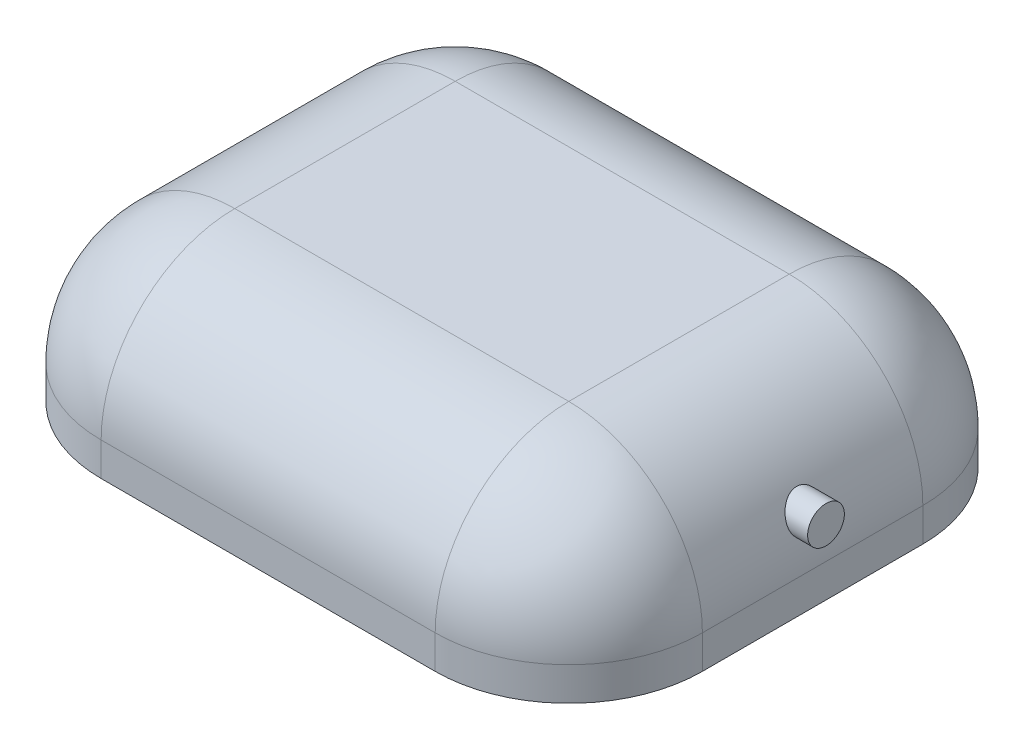
ISO-10303-21;
HEADER;
FILE_DESCRIPTION(('STEP AP214'),'2;1');
FILE_NAME('part.step','',(''),(''),'','','');
FILE_SCHEMA(('AUTOMOTIVE_DESIGN { 1 0 10303 214 1 1 1 1 }'));
ENDSEC;
DATA;
#1=APPLICATION_CONTEXT('core data for automotive mechanical design processes');
#2=APPLICATION_PROTOCOL_DEFINITION('international standard','automotive_design',2000,#1);
#3=PRODUCT_CONTEXT('',#1,'mechanical');
#4=PRODUCT('Part','Part','',(#3));
#5=PRODUCT_RELATED_PRODUCT_CATEGORY('part','',(#4));
#6=PRODUCT_DEFINITION_FORMATION('','',#4);
#7=PRODUCT_DEFINITION_CONTEXT('part definition',#1,'design');
#8=PRODUCT_DEFINITION('design','',#6,#7);
#9=PRODUCT_DEFINITION_SHAPE('','',#8);
#10=(LENGTH_UNIT() NAMED_UNIT(*) SI_UNIT(.MILLI.,.METRE.));
#11=(NAMED_UNIT(*) PLANE_ANGLE_UNIT() SI_UNIT($,.RADIAN.));
#12=(NAMED_UNIT(*) SI_UNIT($,.STERADIAN.) SOLID_ANGLE_UNIT());
#13=UNCERTAINTY_MEASURE_WITH_UNIT(LENGTH_MEASURE(1.E-05),#10,'distance_accuracy_value','');
#14=(GEOMETRIC_REPRESENTATION_CONTEXT(3) GLOBAL_UNCERTAINTY_ASSIGNED_CONTEXT((#13)) GLOBAL_UNIT_ASSIGNED_CONTEXT((#10,
#11,#12)) REPRESENTATION_CONTEXT('',''));
#15=CARTESIAN_POINT('',(0.,0.,0.));
#16=DIRECTION('',(0.,0.,1.));
#17=DIRECTION('',(1.,0.,0.));
#18=AXIS2_PLACEMENT_3D('',#15,#16,#17);
#19=CARTESIAN_POINT('',(22.5,12.5,18.25));
#20=DIRECTION('',(-1.,0.,0.));
#21=DIRECTION('',(0.,0.,1.));
#22=AXIS2_PLACEMENT_3D('',#19,#20,#21);
#23=PLANE('',#22);
#24=DIRECTION('',(0.,0.,-1.));
#25=VECTOR('',#24,1.);
#26=CARTESIAN_POINT('',(22.5,0.,18.25));
#27=LINE('',#26,#25);
#28=CARTESIAN_POINT('',(22.5,0.,8.25));
#29=VERTEX_POINT('',#28);
#30=CARTESIAN_POINT('',(22.5,0.,-8.25));
#31=VERTEX_POINT('',#30);
#32=EDGE_CURVE('E153',#29,#31,#27,.T.);
#33=ORIENTED_EDGE('',*,*,#32,.T.);
#34=DIRECTION('',(0.,-1.,0.));
#35=VECTOR('',#34,1.);
#36=CARTESIAN_POINT('',(22.5,12.5,-8.25));
#37=LINE('',#36,#35);
#38=CARTESIAN_POINT('',(22.5,2.5,-8.25));
#39=VERTEX_POINT('',#38);
#40=EDGE_CURVE('E178',#31,#39,#37,.F.);
#41=ORIENTED_EDGE('',*,*,#40,.T.);
#42=DIRECTION('',(0.,0.,-1.));
#43=VECTOR('',#42,1.);
#44=CARTESIAN_POINT('',(22.5,2.5,18.25));
#45=LINE('',#44,#43);
#46=CARTESIAN_POINT('',(22.5,2.5,8.25));
#47=VERTEX_POINT('',#46);
#48=EDGE_CURVE('E174',#39,#47,#45,.F.);
#49=ORIENTED_EDGE('',*,*,#48,.T.);
#50=DIRECTION('',(0.,-1.,0.));
#51=VECTOR('',#50,1.);
#52=CARTESIAN_POINT('',(22.5,12.5,8.25));
#53=LINE('',#52,#51);
#54=EDGE_CURVE('E176',#47,#29,#53,.T.);
#55=ORIENTED_EDGE('',*,*,#54,.T.);
#56=EDGE_LOOP('',(#33,#41,#49,#55));
#57=FACE_BOUND('',#56,.T.);
#58=ADVANCED_FACE('F34',(#57),#23,.F.);
#59=CARTESIAN_POINT('',(-22.5,12.5,18.25));
#60=DIRECTION('',(-1.,0.,0.));
#61=DIRECTION('',(0.,0.,1.));
#62=AXIS2_PLACEMENT_3D('',#59,#60,#61);
#63=PLANE('',#62);
#64=DIRECTION('',(0.,0.,-1.));
#65=VECTOR('',#64,1.);
#66=CARTESIAN_POINT('',(-22.5,2.5,-18.25));
#67=LINE('',#66,#65);
#68=CARTESIAN_POINT('',(-22.5,2.5,8.25));
#69=VERTEX_POINT('',#68);
#70=CARTESIAN_POINT('',(-22.5,2.5,-8.25));
#71=VERTEX_POINT('',#70);
#72=EDGE_CURVE('E186',#69,#71,#67,.T.);
#73=ORIENTED_EDGE('',*,*,#72,.T.);
#74=DIRECTION('',(0.,-1.,0.));
#75=VECTOR('',#74,1.);
#76=CARTESIAN_POINT('',(-22.5,12.5,-8.25));
#77=LINE('',#76,#75);
#78=CARTESIAN_POINT('',(-22.5,0.,-8.25));
#79=VERTEX_POINT('',#78);
#80=EDGE_CURVE('E190',#71,#79,#77,.T.);
#81=ORIENTED_EDGE('',*,*,#80,.T.);
#82=DIRECTION('',(0.,0.,-1.));
#83=VECTOR('',#82,1.);
#84=CARTESIAN_POINT('',(-22.5,0.,18.25));
#85=LINE('',#84,#83);
#86=CARTESIAN_POINT('',(-22.5,0.,8.25));
#87=VERTEX_POINT('',#86);
#88=EDGE_CURVE('E147',#87,#79,#85,.T.);
#89=ORIENTED_EDGE('',*,*,#88,.F.);
#90=DIRECTION('',(0.,-1.,0.));
#91=VECTOR('',#90,1.);
#92=CARTESIAN_POINT('',(-22.5,12.5,8.25));
#93=LINE('',#92,#91);
#94=EDGE_CURVE('E188',#87,#69,#93,.F.);
#95=ORIENTED_EDGE('',*,*,#94,.T.);
#96=EDGE_LOOP('',(#73,#81,#89,#95));
#97=FACE_BOUND('',#96,.T.);
#98=ADVANCED_FACE('F250',(#97),#63,.T.);
#99=CARTESIAN_POINT('',(-22.5,12.5,18.25));
#100=DIRECTION('',(0.,0.,-1.));
#101=DIRECTION('',(-1.,0.,0.));
#102=AXIS2_PLACEMENT_3D('',#99,#100,#101);
#103=PLANE('',#102);
#104=DIRECTION('',(1.,0.,0.));
#105=VECTOR('',#104,1.);
#106=CARTESIAN_POINT('',(-22.5,0.,18.25));
#107=LINE('',#106,#105);
#108=CARTESIAN_POINT('',(-12.5,0.,18.25));
#109=VERTEX_POINT('',#108);
#110=CARTESIAN_POINT('',(12.5,0.,18.25));
#111=VERTEX_POINT('',#110);
#112=EDGE_CURVE('E156',#109,#111,#107,.T.);
#113=ORIENTED_EDGE('',*,*,#112,.T.);
#114=DIRECTION('',(0.,-1.,0.));
#115=VECTOR('',#114,1.);
#116=CARTESIAN_POINT('',(12.5,12.5,18.25));
#117=LINE('',#116,#115);
#118=CARTESIAN_POINT('',(12.5,2.5,18.25));
#119=VERTEX_POINT('',#118);
#120=EDGE_CURVE('E184',#111,#119,#117,.F.);
#121=ORIENTED_EDGE('',*,*,#120,.T.);
#122=DIRECTION('',(1.,0.,0.));
#123=VECTOR('',#122,1.);
#124=CARTESIAN_POINT('',(-22.5,2.5,18.25));
#125=LINE('',#124,#123);
#126=CARTESIAN_POINT('',(-12.5,2.5,18.25));
#127=VERTEX_POINT('',#126);
#128=EDGE_CURVE('E180',#119,#127,#125,.F.);
#129=ORIENTED_EDGE('',*,*,#128,.T.);
#130=DIRECTION('',(0.,-1.,0.));
#131=VECTOR('',#130,1.);
#132=CARTESIAN_POINT('',(-12.5,0.,18.25));
#133=LINE('',#132,#131);
#134=EDGE_CURVE('E182',#127,#109,#133,.T.);
#135=ORIENTED_EDGE('',*,*,#134,.T.);
#136=EDGE_LOOP('',(#113,#121,#129,#135));
#137=FACE_BOUND('',#136,.T.);
#138=ADVANCED_FACE('F297',(#137),#103,.F.);
#139=CARTESIAN_POINT('',(-22.5,12.5,-18.25));
#140=DIRECTION('',(0.,0.,-1.));
#141=DIRECTION('',(-1.,0.,0.));
#142=AXIS2_PLACEMENT_3D('',#139,#140,#141);
#143=PLANE('',#142);
#144=DIRECTION('',(1.,0.,0.));
#145=VECTOR('',#144,1.);
#146=CARTESIAN_POINT('',(22.5,2.5,-18.25));
#147=LINE('',#146,#145);
#148=CARTESIAN_POINT('',(-12.5,2.5,-18.25));
#149=VERTEX_POINT('',#148);
#150=CARTESIAN_POINT('',(12.5,2.5,-18.25));
#151=VERTEX_POINT('',#150);
#152=EDGE_CURVE('E159',#149,#151,#147,.T.);
#153=ORIENTED_EDGE('',*,*,#152,.T.);
#154=DIRECTION('',(0.,-1.,0.));
#155=VECTOR('',#154,1.);
#156=CARTESIAN_POINT('',(12.5,0.,-18.25));
#157=LINE('',#156,#155);
#158=CARTESIAN_POINT('',(12.5,0.,-18.25));
#159=VERTEX_POINT('',#158);
#160=EDGE_CURVE('E163',#151,#159,#157,.T.);
#161=ORIENTED_EDGE('',*,*,#160,.T.);
#162=DIRECTION('',(1.,0.,0.));
#163=VECTOR('',#162,1.);
#164=CARTESIAN_POINT('',(-22.5,0.,-18.25));
#165=LINE('',#164,#163);
#166=CARTESIAN_POINT('',(-12.5,0.,-18.25));
#167=VERTEX_POINT('',#166);
#168=EDGE_CURVE('E150',#167,#159,#165,.T.);
#169=ORIENTED_EDGE('',*,*,#168,.F.);
#170=DIRECTION('',(0.,-1.,0.));
#171=VECTOR('',#170,1.);
#172=CARTESIAN_POINT('',(-12.5,12.5,-18.25));
#173=LINE('',#172,#171);
#174=EDGE_CURVE('E161',#167,#149,#173,.F.);
#175=ORIENTED_EDGE('',*,*,#174,.T.);
#176=EDGE_LOOP('',(#153,#161,#169,#175));
#177=FACE_BOUND('',#176,.T.);
#178=ADVANCED_FACE('F262',(#177),#143,.T.);
#179=CARTESIAN_POINT('',(0.,12.5,0.));
#180=DIRECTION('',(0.,-1.,0.));
#181=DIRECTION('',(0.,0.,-1.));
#182=AXIS2_PLACEMENT_3D('',#179,#180,#181);
#183=PLANE('',#182);
#184=DIRECTION('',(1.,0.,0.));
#185=VECTOR('',#184,1.);
#186=CARTESIAN_POINT('',(0.,12.5,8.25));
#187=LINE('',#186,#185);
#188=CARTESIAN_POINT('',(-12.5,12.5,8.25));
#189=VERTEX_POINT('',#188);
#190=CARTESIAN_POINT('',(12.5,12.5,8.25));
#191=VERTEX_POINT('',#190);
#192=EDGE_CURVE('E192',#189,#191,#187,.T.);
#193=ORIENTED_EDGE('',*,*,#192,.T.);
#194=DIRECTION('',(0.,0.,-1.));
#195=VECTOR('',#194,1.);
#196=CARTESIAN_POINT('',(12.5,12.5,0.));
#197=LINE('',#196,#195);
#198=CARTESIAN_POINT('',(12.5,12.5,-8.25));
#199=VERTEX_POINT('',#198);
#200=EDGE_CURVE('E11',#191,#199,#197,.T.);
#201=ORIENTED_EDGE('',*,*,#200,.T.);
#202=DIRECTION('',(1.,0.,0.));
#203=VECTOR('',#202,1.);
#204=CARTESIAN_POINT('',(-22.5,12.5,-8.25));
#205=LINE('',#204,#203);
#206=CARTESIAN_POINT('',(-12.5,12.5,-8.25));
#207=VERTEX_POINT('',#206);
#208=EDGE_CURVE('E47',#199,#207,#205,.F.);
#209=ORIENTED_EDGE('',*,*,#208,.T.);
#210=DIRECTION('',(0.,0.,-1.));
#211=VECTOR('',#210,1.);
#212=CARTESIAN_POINT('',(-12.5,12.5,18.25));
#213=LINE('',#212,#211);
#214=EDGE_CURVE('E194',#207,#189,#213,.F.);
#215=ORIENTED_EDGE('',*,*,#214,.T.);
#216=EDGE_LOOP('',(#193,#201,#209,#215));
#217=FACE_BOUND('',#216,.T.);
#218=ADVANCED_FACE('F243',(#217),#183,.F.);
#219=CARTESIAN_POINT('',(0.,0.,0.));
#220=DIRECTION('',(0.,-1.,0.));
#221=DIRECTION('',(0.,0.,-1.));
#222=AXIS2_PLACEMENT_3D('',#219,#220,#221);
#223=PLANE('',#222);
#224=CARTESIAN_POINT('',(-15.6,0.,-7.25));
#225=DIRECTION('',(0.,-1.,0.));
#226=DIRECTION('',(0.,0.,-1.));
#227=AXIS2_PLACEMENT_3D('',#224,#225,#226);
#228=CIRCLE('',#227,1.02499999999999);
#229=CARTESIAN_POINT('',(-15.6,0.,-8.27499999999999));
#230=VERTEX_POINT('',#229);
#231=EDGE_CURVE('E133',#230,#230,#228,.T.);
#232=ORIENTED_EDGE('',*,*,#231,.F.);
#233=EDGE_LOOP('',(#232));
#234=FACE_BOUND('',#233,.T.);
#235=CARTESIAN_POINT('',(14.1,0.,7.65));
#236=DIRECTION('',(0.,-1.,0.));
#237=DIRECTION('',(0.,0.,-1.));
#238=AXIS2_PLACEMENT_3D('',#235,#236,#237);
#239=CIRCLE('',#238,1.02499999999999);
#240=CARTESIAN_POINT('',(14.1,0.,6.62500000000001));
#241=VERTEX_POINT('',#240);
#242=EDGE_CURVE('E132',#241,#241,#239,.T.);
#243=ORIENTED_EDGE('',*,*,#242,.F.);
#244=EDGE_LOOP('',(#243));
#245=FACE_BOUND('',#244,.T.);
#246=ORIENTED_EDGE('',*,*,#168,.T.);
#247=CARTESIAN_POINT('',(12.5,0.,-8.25));
#248=DIRECTION('',(0.,-1.,0.));
#249=DIRECTION('',(0.,0.,-1.));
#250=AXIS2_PLACEMENT_3D('',#247,#248,#249);
#251=CIRCLE('',#250,10.);
#252=EDGE_CURVE('E172',#159,#31,#251,.T.);
#253=ORIENTED_EDGE('',*,*,#252,.T.);
#254=ORIENTED_EDGE('',*,*,#32,.F.);
#255=CARTESIAN_POINT('',(12.5,0.,8.25));
#256=DIRECTION('',(0.,-1.,0.));
#257=DIRECTION('',(0.,0.,-1.));
#258=AXIS2_PLACEMENT_3D('',#255,#256,#257);
#259=CIRCLE('',#258,10.);
#260=EDGE_CURVE('E170',#29,#111,#259,.T.);
#261=ORIENTED_EDGE('',*,*,#260,.T.);
#262=ORIENTED_EDGE('',*,*,#112,.F.);
#263=CARTESIAN_POINT('',(-12.5,0.,8.25));
#264=DIRECTION('',(0.,-1.,0.));
#265=DIRECTION('',(0.,0.,-1.));
#266=AXIS2_PLACEMENT_3D('',#263,#264,#265);
#267=CIRCLE('',#266,10.);
#268=EDGE_CURVE('E166',#109,#87,#267,.T.);
#269=ORIENTED_EDGE('',*,*,#268,.T.);
#270=ORIENTED_EDGE('',*,*,#88,.T.);
#271=CARTESIAN_POINT('',(-12.5,0.,-8.25));
#272=DIRECTION('',(0.,-1.,0.));
#273=DIRECTION('',(0.,0.,-1.));
#274=AXIS2_PLACEMENT_3D('',#271,#272,#273);
#275=CIRCLE('',#274,10.);
#276=EDGE_CURVE('E168',#79,#167,#275,.T.);
#277=ORIENTED_EDGE('',*,*,#276,.T.);
#278=EDGE_LOOP('',(#246,#253,#254,#261,#262,#269,#270,#277));
#279=FACE_BOUND('',#278,.T.);
#280=ADVANCED_FACE('F260',(#234,#245,#279),#223,.T.);
#281=CARTESIAN_POINT('',(23.5,5.8846011788205,0.));
#282=DIRECTION('',(-1.,0.,0.));
#283=DIRECTION('',(0.,0.,1.));
#284=AXIS2_PLACEMENT_3D('',#281,#282,#283);
#285=CYLINDRICAL_SURFACE('',#284,1.375);
#286=CARTESIAN_POINT('',(23.5,5.8846011788205,0.));
#287=DIRECTION('',(1.,0.,0.));
#288=DIRECTION('',(0.,0.,-1.));
#289=AXIS2_PLACEMENT_3D('',#286,#287,#288);
#290=CIRCLE('',#289,1.375);
#291=CARTESIAN_POINT('',(23.5,5.8846011788205,-1.375));
#292=VERTEX_POINT('',#291);
#293=EDGE_CURVE('E144',#292,#292,#290,.T.);
#294=ORIENTED_EDGE('',*,*,#293,.F.);
#295=EDGE_LOOP('',(#294));
#296=FACE_BOUND('',#295,.T.);
#297=CARTESIAN_POINT('',(21.9717337782845,5.70721986045659,-1.36351049423821));
#298=CARTESIAN_POINT('',(21.9439542981812,5.78925396430101,-1.37417866736904));
#299=CARTESIAN_POINT('',(21.914781384248,5.8718657946922,-1.37737732042278));
#300=CARTESIAN_POINT('',(21.8544807209374,6.03572424250683,-1.36913845678424));
#301=CARTESIAN_POINT('',(21.8233496687765,6.11696824353133,-1.35767554491773));
#302=CARTESIAN_POINT('',(21.7602206684808,6.27565737641086,-1.32072761204345));
#303=CARTESIAN_POINT('',(21.7282245384059,6.35310963965792,-1.2952701091719));
#304=CARTESIAN_POINT('',(21.6644681147841,6.50238887824185,-1.23108312261254));
#305=CARTESIAN_POINT('',(21.6327077812852,6.57421682717,-1.19235594222632));
#306=CARTESIAN_POINT('',(21.5701056155181,6.71177055003275,-1.10151980405765));
#307=CARTESIAN_POINT('',(21.5392957064655,6.77734207655248,-1.04915414312677));
#308=CARTESIAN_POINT('',(21.4809126695111,6.89860686783092,-0.932465763653556));
#309=CARTESIAN_POINT('',(21.4533393193683,6.95430081097648,-0.868143866880644));
#310=CARTESIAN_POINT('',(21.4044835473387,7.05115136200574,-0.732388642611647));
#311=CARTESIAN_POINT('',(21.3829593445938,7.09288589259148,-0.661457199982883));
#312=CARTESIAN_POINT('',(21.3461434978007,7.1634045307849,-0.511953636956811));
#313=CARTESIAN_POINT('',(21.3308451600391,7.19220255050775,-0.433389835673725));
#314=CARTESIAN_POINT('',(21.3091748111358,7.23274850602687,-0.280463908689695));
#315=CARTESIAN_POINT('',(21.3019897905479,7.24605476066818,-0.206629379716066));
#316=CARTESIAN_POINT('',(21.294219505859,7.26043872479069,-0.0574488145971453));
#317=CARTESIAN_POINT('',(21.2936303612144,7.26152362444896,0.01789630667914));
#318=CARTESIAN_POINT('',(21.2988595733714,7.25185115497746,0.161147120637676));
#319=CARTESIAN_POINT('',(21.3041402201154,7.24208760350882,0.229143056381329));
#320=CARTESIAN_POINT('',(21.3198787684655,7.21275003153759,0.362349257047841));
#321=CARTESIAN_POINT('',(21.3303369062225,7.19317556354815,0.427559394760096));
#322=CARTESIAN_POINT('',(21.3559552890664,7.14465439755929,0.554608339870301));
#323=CARTESIAN_POINT('',(21.3711873811134,7.11556417563477,0.616377396762683));
#324=CARTESIAN_POINT('',(21.4054215734884,7.04916026510925,0.734168401135945));
#325=CARTESIAN_POINT('',(21.4244249123799,7.01184387439922,0.79018845131724));
#326=CARTESIAN_POINT('',(21.4672223954803,6.92621934161097,0.900545710748188));
#327=CARTESIAN_POINT('',(21.4912993668808,6.87720637782496,0.954225651388797));
#328=CARTESIAN_POINT('',(21.5417499252771,6.77202094188656,1.05276367275533));
#329=CARTESIAN_POINT('',(21.5681245885931,6.71584510861795,1.09761758665037));
#330=CARTESIAN_POINT('',(21.6249960228667,6.59140516626553,1.18206759914762));
#331=CARTESIAN_POINT('',(21.6556344632991,6.52249105463254,1.22061328262666));
#332=CARTESIAN_POINT('',(21.7172527347878,6.37921863432792,1.28536499884478));
#333=CARTESIAN_POINT('',(21.7482326815162,6.30485842966672,1.31156671036185));
#334=CARTESIAN_POINT('',(21.8110908561365,6.14843127756096,1.35199131562527));
#335=CARTESIAN_POINT('',(21.8429301575235,6.06616471775316,1.3655087523532));
#336=CARTESIAN_POINT('',(21.9047321502365,5.89983542541304,1.37744050574667));
#337=CARTESIAN_POINT('',(21.934694951928,5.81577279890642,1.37585571148524));
#338=CARTESIAN_POINT('',(21.991322341206,5.6499732600429,1.35735061151682));
#339=CARTESIAN_POINT('',(22.0180380353478,5.56822221815994,1.34071698152274));
#340=CARTESIAN_POINT('',(22.0681543162141,5.40816979731161,1.29252280372589));
#341=CARTESIAN_POINT('',(22.0915560386775,5.32986724287679,1.26096738596971));
#342=CARTESIAN_POINT('',(22.1334357717643,5.18372567790763,1.18565608419186));
#343=CARTESIAN_POINT('',(22.1521141677061,5.11554774672442,1.14266916278509));
#344=CARTESIAN_POINT('',(22.1859726050871,4.98723580483895,1.04492046187424));
#345=CARTESIAN_POINT('',(22.2011536327203,4.92709952854828,0.990162010167057));
#346=CARTESIAN_POINT('',(22.2273775984608,4.819707853237,0.873284570684972));
#347=CARTESIAN_POINT('',(22.2385829052473,4.77197613119141,0.811639044340337));
#348=CARTESIAN_POINT('',(22.2579166378704,4.68745270820466,0.680824119442258));
#349=CARTESIAN_POINT('',(22.2660455217756,4.65065937875032,0.61165584297592));
#350=CARTESIAN_POINT('',(22.279197156736,4.59003501891782,0.469617067772423));
#351=CARTESIAN_POINT('',(22.284291531467,4.56590683753424,0.396879848586726));
#352=CARTESIAN_POINT('',(22.2917954515412,4.53004463227972,0.248278806986295));
#353=CARTESIAN_POINT('',(22.2942051503267,4.5183099000647,0.172415163518991));
#354=CARTESIAN_POINT('',(22.2963933749136,4.50766195996665,0.0204238069356428));
#355=CARTESIAN_POINT('',(22.2961946609191,4.50863784260551,-0.0556958351849992));
#356=CARTESIAN_POINT('',(22.2932159857796,4.52310998223769,-0.206683052841491));
#357=CARTESIAN_POINT('',(22.2904360765158,4.53660598757997,-0.281550653512239));
#358=CARTESIAN_POINT('',(22.2822299041175,4.57566180780108,-0.427814373046293));
#359=CARTESIAN_POINT('',(22.276807000623,4.60120630592224,-0.499214772872235));
#360=CARTESIAN_POINT('',(22.2632032751731,4.66353265849295,-0.636638700076092));
#361=CARTESIAN_POINT('',(22.255022586335,4.7003139705374,-0.702662486790285));
#362=CARTESIAN_POINT('',(22.2357442250398,4.78410450692929,-0.827782780518));
#363=CARTESIAN_POINT('',(22.2246347456409,4.83115499457268,-0.886849815587712));
#364=CARTESIAN_POINT('',(22.199430639183,4.93389316095769,-0.996197165924145));
#365=CARTESIAN_POINT('',(22.1853352421559,4.98958306652206,-1.04647520868913));
#366=CARTESIAN_POINT('',(22.1539348257094,5.10871409564601,-1.13768987881307));
#367=CARTESIAN_POINT('',(22.1365850155427,5.17225855975782,-1.17847578100064));
#368=CARTESIAN_POINT('',(22.0989584757922,5.30440708931484,-1.2488373156395));
#369=CARTESIAN_POINT('',(22.0786845596654,5.37300626064136,-1.27842362582236));
#370=CARTESIAN_POINT('',(22.0438086711842,5.48626282888791,-1.31682683607673));
#371=CARTESIAN_POINT('',(22.0300225737675,5.52998575623435,-1.32925563938914));
#372=CARTESIAN_POINT('',(22.0015396211325,5.61815546057629,-1.34969621897236));
#373=CARTESIAN_POINT('',(21.9868428010792,5.66260220957458,-1.35770816567004));
#374=CARTESIAN_POINT('',(21.9717337782845,5.70721986045659,-1.36351049423821));
#375=B_SPLINE_CURVE_WITH_KNOTS('',3,(#297,#298,#299,#300,#301,#302,#303,#304,#305,#306,#307,
#308,#309,#310,#311,#312,#313,#314,#315,#316,#317,#318,#319,#320,#321,#322,#323,#324,#325,#326,
#327,#328,#329,#330,#331,#332,#333,#334,#335,#336,#337,#338,#339,#340,#341,#342,#343,#344,#345,
#346,#347,#348,#349,#350,#351,#352,#353,#354,#355,#356,#357,#358,#359,#360,#361,#362,#363,#364,
#365,#366,#367,#368,#369,#370,#371,#372,#373,#374),.UNSPECIFIED.,.T.,.F.,(4,2,2,2,2,2,2,2,2,2,2,
2,2,2,2,2,2,2,2,2,2,2,2,2,2,2,2,2,2,2,2,2,2,2,2,2,2,2,4),(0.,0.261613686888187,
0.523681126903943,0.78523508675873,1.04674367002298,1.31358329690658,1.58040459029252,
1.83417177830759,2.0876654041448,2.31252912615437,2.53726054741025,2.74298496193525,
2.94871876063445,3.15771089248333,3.36677177605053,3.59555425113471,3.82444447828976,
4.07742786247818,4.33049974221269,4.59693260313074,4.86334977916058,5.12479624665864,
5.38615289525954,5.6330935515544,5.87996448962331,6.11510341464501,6.35020731451835,
6.57951618188104,6.80881194245082,7.03610827895119,7.26340004695653,7.49040364379519,
7.71739628481859,7.94531838711687,8.17329933458122,8.40468510185653,8.63584970612863,
8.77814465472608,8.92043411240908),.UNSPECIFIED.);
#376=CARTESIAN_POINT('',(21.9717337782845,5.70721986045659,-1.36351049423821));
#377=VERTEX_POINT('',#376);
#378=EDGE_CURVE('E38',#377,#377,#375,.T.);
#379=ORIENTED_EDGE('',*,*,#378,.T.);
#380=EDGE_LOOP('',(#379));
#381=FACE_BOUND('',#380,.T.);
#382=ADVANCED_FACE('F421',(#296,#381),#285,.T.);
#383=CARTESIAN_POINT('',(23.5,5.8846011788205,0.));
#384=DIRECTION('',(1.,0.,0.));
#385=DIRECTION('',(0.,0.,-1.));
#386=AXIS2_PLACEMENT_3D('',#383,#384,#385);
#387=PLANE('',#386);
#388=ORIENTED_EDGE('',*,*,#293,.T.);
#389=EDGE_LOOP('',(#388));
#390=FACE_BOUND('',#389,.T.);
#391=ADVANCED_FACE('F412',(#390),#387,.T.);
#392=CARTESIAN_POINT('',(14.1,3.,7.65));
#393=DIRECTION('',(0.,-1.,0.));
#394=DIRECTION('',(0.,0.,-1.));
#395=AXIS2_PLACEMENT_3D('',#392,#393,#394);
#396=CONICAL_SURFACE('',#395,1.025,1.02974425867665);
#397=CARTESIAN_POINT('',(14.1,3.61588213450325,7.65));
#398=VERTEX_POINT('',#397);
#399=VERTEX_LOOP('',#398);
#400=FACE_BOUND('',#399,.T.);
#401=CARTESIAN_POINT('',(14.1,3.,7.65));
#402=DIRECTION('',(0.,-1.,0.));
#403=DIRECTION('',(0.,0.,-1.));
#404=AXIS2_PLACEMENT_3D('',#401,#402,#403);
#405=CIRCLE('',#404,1.025);
#406=CARTESIAN_POINT('',(14.1,3.,6.625));
#407=VERTEX_POINT('',#406);
#408=EDGE_CURVE('E136',#407,#407,#405,.T.);
#409=ORIENTED_EDGE('',*,*,#408,.T.);
#410=EDGE_LOOP('',(#409));
#411=FACE_BOUND('',#410,.T.);
#412=ADVANCED_FACE('F403',(#400,#411),#396,.F.);
#413=CARTESIAN_POINT('',(14.1,0.,7.65));
#414=DIRECTION('',(0.,-1.,0.));
#415=DIRECTION('',(0.,0.,-1.));
#416=AXIS2_PLACEMENT_3D('',#413,#414,#415);
#417=CYLINDRICAL_SURFACE('',#416,1.02499999999999);
#418=ORIENTED_EDGE('',*,*,#408,.F.);
#419=EDGE_LOOP('',(#418));
#420=FACE_BOUND('',#419,.T.);
#421=ORIENTED_EDGE('',*,*,#242,.T.);
#422=EDGE_LOOP('',(#421));
#423=FACE_BOUND('',#422,.T.);
#424=ADVANCED_FACE('F126',(#420,#423),#417,.F.);
#425=CARTESIAN_POINT('',(-15.6,3.,-7.25));
#426=DIRECTION('',(0.,-1.,0.));
#427=DIRECTION('',(0.,0.,-1.));
#428=AXIS2_PLACEMENT_3D('',#425,#426,#427);
#429=CONICAL_SURFACE('',#428,1.025,1.02974425867665);
#430=CARTESIAN_POINT('',(-15.6,3.61588213450325,-7.25));
#431=VERTEX_POINT('',#430);
#432=VERTEX_LOOP('',#431);
#433=FACE_BOUND('',#432,.T.);
#434=CARTESIAN_POINT('',(-15.6,3.,-7.25));
#435=DIRECTION('',(0.,-1.,0.));
#436=DIRECTION('',(0.,0.,-1.));
#437=AXIS2_PLACEMENT_3D('',#434,#435,#436);
#438=CIRCLE('',#437,1.025);
#439=CARTESIAN_POINT('',(-15.6,3.,-8.275));
#440=VERTEX_POINT('',#439);
#441=EDGE_CURVE('E130',#440,#440,#438,.T.);
#442=ORIENTED_EDGE('',*,*,#441,.T.);
#443=EDGE_LOOP('',(#442));
#444=FACE_BOUND('',#443,.T.);
#445=ADVANCED_FACE('F122',(#433,#444),#429,.F.);
#446=CARTESIAN_POINT('',(-15.6,0.,-7.25));
#447=DIRECTION('',(0.,-1.,0.));
#448=DIRECTION('',(0.,0.,-1.));
#449=AXIS2_PLACEMENT_3D('',#446,#447,#448);
#450=CYLINDRICAL_SURFACE('',#449,1.02499999999999);
#451=ORIENTED_EDGE('',*,*,#441,.F.);
#452=EDGE_LOOP('',(#451));
#453=FACE_BOUND('',#452,.T.);
#454=ORIENTED_EDGE('',*,*,#231,.T.);
#455=EDGE_LOOP('',(#454));
#456=FACE_BOUND('',#455,.T.);
#457=ADVANCED_FACE('F125',(#453,#456),#450,.F.);
#458=CARTESIAN_POINT('',(-12.5,12.5,8.25));
#459=DIRECTION('',(0.,1.,0.));
#460=DIRECTION('',(0.,0.,1.));
#461=AXIS2_PLACEMENT_3D('',#458,#459,#460);
#462=CYLINDRICAL_SURFACE('',#461,10.);
#463=CARTESIAN_POINT('',(-12.5,2.5,8.25));
#464=DIRECTION('',(0.,1.,0.));
#465=DIRECTION('',(0.,0.,1.));
#466=AXIS2_PLACEMENT_3D('',#463,#464,#465);
#467=CIRCLE('',#466,10.);
#468=EDGE_CURVE('E139',#69,#127,#467,.T.);
#469=ORIENTED_EDGE('',*,*,#468,.F.);
#470=ORIENTED_EDGE('',*,*,#94,.F.);
#471=ORIENTED_EDGE('',*,*,#268,.F.);
#472=ORIENTED_EDGE('',*,*,#134,.F.);
#473=EDGE_LOOP('',(#469,#470,#471,#472));
#474=FACE_BOUND('',#473,.T.);
#475=ADVANCED_FACE('F36',(#474),#462,.T.);
#476=CARTESIAN_POINT('',(-12.5,2.5,8.25));
#477=DIRECTION('',(0.,0.,1.));
#478=DIRECTION('',(1.,0.,0.));
#479=AXIS2_PLACEMENT_3D('',#476,#477,#478);
#480=SPHERICAL_SURFACE('',#479,10.);
#481=CARTESIAN_POINT('',(-12.5,2.5,8.25));
#482=DIRECTION('',(0.,0.,1.));
#483=DIRECTION('',(1.,0.,0.));
#484=AXIS2_PLACEMENT_3D('',#481,#482,#483);
#485=CIRCLE('',#484,10.);
#486=EDGE_CURVE('E221',#69,#189,#485,.F.);
#487=ORIENTED_EDGE('',*,*,#486,.F.);
#488=ORIENTED_EDGE('',*,*,#468,.T.);
#489=CARTESIAN_POINT('',(-12.5,2.5,8.25));
#490=DIRECTION('',(-1.,0.,0.));
#491=DIRECTION('',(0.,0.,1.));
#492=AXIS2_PLACEMENT_3D('',#489,#490,#491);
#493=CIRCLE('',#492,10.);
#494=EDGE_CURVE('E224',#189,#127,#493,.F.);
#495=ORIENTED_EDGE('',*,*,#494,.F.);
#496=EDGE_LOOP('',(#487,#488,#495));
#497=FACE_BOUND('',#496,.T.);
#498=ADVANCED_FACE('F231',(#497),#480,.T.);
#499=CARTESIAN_POINT('',(12.5,12.5,8.25));
#500=DIRECTION('',(0.,-1.,0.));
#501=DIRECTION('',(0.,0.,-1.));
#502=AXIS2_PLACEMENT_3D('',#499,#500,#501);
#503=CYLINDRICAL_SURFACE('',#502,10.);
#504=ORIENTED_EDGE('',*,*,#260,.F.);
#505=ORIENTED_EDGE('',*,*,#54,.F.);
#506=CARTESIAN_POINT('',(12.5,2.5,8.25));
#507=DIRECTION('',(0.,1.,0.));
#508=DIRECTION('',(0.,0.,1.));
#509=AXIS2_PLACEMENT_3D('',#506,#507,#508);
#510=CIRCLE('',#509,10.);
#511=EDGE_CURVE('E218',#119,#47,#510,.T.);
#512=ORIENTED_EDGE('',*,*,#511,.F.);
#513=ORIENTED_EDGE('',*,*,#120,.F.);
#514=EDGE_LOOP('',(#504,#505,#512,#513));
#515=FACE_BOUND('',#514,.T.);
#516=ADVANCED_FACE('F274',(#515),#503,.T.);
#517=CARTESIAN_POINT('',(0.,2.5,8.25));
#518=DIRECTION('',(1.,0.,0.));
#519=DIRECTION('',(0.,0.,-1.));
#520=AXIS2_PLACEMENT_3D('',#517,#518,#519);
#521=CYLINDRICAL_SURFACE('',#520,10.);
#522=ORIENTED_EDGE('',*,*,#494,.T.);
#523=ORIENTED_EDGE('',*,*,#128,.F.);
#524=CARTESIAN_POINT('',(12.5,2.5,8.25));
#525=DIRECTION('',(1.,0.,0.));
#526=DIRECTION('',(0.,0.,-1.));
#527=AXIS2_PLACEMENT_3D('',#524,#525,#526);
#528=CIRCLE('',#527,10.);
#529=EDGE_CURVE('E215',#191,#119,#528,.T.);
#530=ORIENTED_EDGE('',*,*,#529,.F.);
#531=ORIENTED_EDGE('',*,*,#192,.F.);
#532=EDGE_LOOP('',(#522,#523,#530,#531));
#533=FACE_BOUND('',#532,.T.);
#534=ADVANCED_FACE('F239',(#533),#521,.T.);
#535=CARTESIAN_POINT('',(-12.5,2.5,18.25));
#536=DIRECTION('',(0.,0.,1.));
#537=DIRECTION('',(1.,0.,0.));
#538=AXIS2_PLACEMENT_3D('',#535,#536,#537);
#539=CYLINDRICAL_SURFACE('',#538,10.);
#540=ORIENTED_EDGE('',*,*,#486,.T.);
#541=ORIENTED_EDGE('',*,*,#214,.F.);
#542=CARTESIAN_POINT('',(-12.5,2.5,-8.25));
#543=DIRECTION('',(0.,0.,-1.));
#544=DIRECTION('',(-1.,0.,0.));
#545=AXIS2_PLACEMENT_3D('',#542,#543,#544);
#546=CIRCLE('',#545,10.);
#547=EDGE_CURVE('E212',#71,#207,#546,.T.);
#548=ORIENTED_EDGE('',*,*,#547,.F.);
#549=ORIENTED_EDGE('',*,*,#72,.F.);
#550=EDGE_LOOP('',(#540,#541,#548,#549));
#551=FACE_BOUND('',#550,.T.);
#552=ADVANCED_FACE('F247',(#551),#539,.T.);
#553=CARTESIAN_POINT('',(-12.5,12.5,-8.25));
#554=DIRECTION('',(0.,-1.,0.));
#555=DIRECTION('',(0.,0.,-1.));
#556=AXIS2_PLACEMENT_3D('',#553,#554,#555);
#557=CYLINDRICAL_SURFACE('',#556,10.);
#558=ORIENTED_EDGE('',*,*,#276,.F.);
#559=ORIENTED_EDGE('',*,*,#80,.F.);
#560=CARTESIAN_POINT('',(-12.5,2.5,-8.25));
#561=DIRECTION('',(0.,1.,0.));
#562=DIRECTION('',(0.,0.,1.));
#563=AXIS2_PLACEMENT_3D('',#560,#561,#562);
#564=CIRCLE('',#563,10.);
#565=EDGE_CURVE('E209',#149,#71,#564,.T.);
#566=ORIENTED_EDGE('',*,*,#565,.F.);
#567=ORIENTED_EDGE('',*,*,#174,.F.);
#568=EDGE_LOOP('',(#558,#559,#566,#567));
#569=FACE_BOUND('',#568,.T.);
#570=ADVANCED_FACE('F255',(#569),#557,.T.);
#571=CARTESIAN_POINT('',(12.5,2.5,8.25));
#572=DIRECTION('',(0.,0.,1.));
#573=DIRECTION('',(1.,0.,0.));
#574=AXIS2_PLACEMENT_3D('',#571,#572,#573);
#575=SPHERICAL_SURFACE('',#574,10.);
#576=ORIENTED_EDGE('',*,*,#529,.T.);
#577=ORIENTED_EDGE('',*,*,#511,.T.);
#578=CARTESIAN_POINT('',(12.5,2.5,8.25));
#579=DIRECTION('',(0.,0.,1.));
#580=DIRECTION('',(1.,0.,0.));
#581=AXIS2_PLACEMENT_3D('',#578,#579,#580);
#582=CIRCLE('',#581,10.);
#583=EDGE_CURVE('E206',#191,#47,#582,.F.);
#584=ORIENTED_EDGE('',*,*,#583,.F.);
#585=EDGE_LOOP('',(#576,#577,#584));
#586=FACE_BOUND('',#585,.T.);
#587=ADVANCED_FACE('F277',(#586),#575,.T.);
#588=CARTESIAN_POINT('',(-12.5,2.5,-8.25));
#589=DIRECTION('',(0.,0.,1.));
#590=DIRECTION('',(1.,0.,0.));
#591=AXIS2_PLACEMENT_3D('',#588,#589,#590);
#592=SPHERICAL_SURFACE('',#591,10.);
#593=ORIENTED_EDGE('',*,*,#565,.T.);
#594=ORIENTED_EDGE('',*,*,#547,.T.);
#595=CARTESIAN_POINT('',(-12.5,2.5,-8.25));
#596=DIRECTION('',(-1.,0.,0.));
#597=DIRECTION('',(0.,0.,1.));
#598=AXIS2_PLACEMENT_3D('',#595,#596,#597);
#599=CIRCLE('',#598,10.);
#600=EDGE_CURVE('E203',#149,#207,#599,.F.);
#601=ORIENTED_EDGE('',*,*,#600,.F.);
#602=EDGE_LOOP('',(#593,#594,#601));
#603=FACE_BOUND('',#602,.T.);
#604=ADVANCED_FACE('F284',(#603),#592,.T.);
#605=CARTESIAN_POINT('',(12.5,2.5,0.));
#606=DIRECTION('',(0.,0.,-1.));
#607=DIRECTION('',(-1.,0.,0.));
#608=AXIS2_PLACEMENT_3D('',#605,#606,#607);
#609=CYLINDRICAL_SURFACE('',#608,10.);
#610=ORIENTED_EDGE('',*,*,#583,.T.);
#611=ORIENTED_EDGE('',*,*,#48,.F.);
#612=CARTESIAN_POINT('',(12.5,2.5,-8.25));
#613=DIRECTION('',(0.,0.,-1.));
#614=DIRECTION('',(-1.,0.,0.));
#615=AXIS2_PLACEMENT_3D('',#612,#613,#614);
#616=CIRCLE('',#615,10.);
#617=EDGE_CURVE('E201',#199,#39,#616,.T.);
#618=ORIENTED_EDGE('',*,*,#617,.F.);
#619=ORIENTED_EDGE('',*,*,#200,.F.);
#620=EDGE_LOOP('',(#610,#611,#618,#619));
#621=FACE_BOUND('',#620,.T.);
#622=ORIENTED_EDGE('',*,*,#378,.F.);
#623=EDGE_LOOP('',(#622));
#624=FACE_BOUND('',#623,.T.);
#625=ADVANCED_FACE('F279',(#621,#624),#609,.T.);
#626=CARTESIAN_POINT('',(-22.5,2.5,-8.25));
#627=DIRECTION('',(-1.,0.,0.));
#628=DIRECTION('',(0.,0.,1.));
#629=AXIS2_PLACEMENT_3D('',#626,#627,#628);
#630=CYLINDRICAL_SURFACE('',#629,10.);
#631=ORIENTED_EDGE('',*,*,#600,.T.);
#632=ORIENTED_EDGE('',*,*,#208,.F.);
#633=CARTESIAN_POINT('',(12.5,2.5,-8.25));
#634=DIRECTION('',(1.,0.,0.));
#635=DIRECTION('',(0.,1.,0.));
#636=AXIS2_PLACEMENT_3D('',#633,#634,#635);
#637=CIRCLE('',#636,10.);
#638=EDGE_CURVE('E55',#151,#199,#637,.T.);
#639=ORIENTED_EDGE('',*,*,#638,.F.);
#640=ORIENTED_EDGE('',*,*,#152,.F.);
#641=EDGE_LOOP('',(#631,#632,#639,#640));
#642=FACE_BOUND('',#641,.T.);
#643=ADVANCED_FACE('F282',(#642),#630,.T.);
#644=CARTESIAN_POINT('',(12.5,2.5,-8.25));
#645=DIRECTION('',(0.,0.,1.));
#646=DIRECTION('',(1.,0.,0.));
#647=AXIS2_PLACEMENT_3D('',#644,#645,#646);
#648=SPHERICAL_SURFACE('',#647,10.);
#649=ORIENTED_EDGE('',*,*,#638,.T.);
#650=ORIENTED_EDGE('',*,*,#617,.T.);
#651=CARTESIAN_POINT('',(12.5,2.5,-8.25));
#652=DIRECTION('',(0.,1.,0.));
#653=DIRECTION('',(0.,0.,1.));
#654=AXIS2_PLACEMENT_3D('',#651,#652,#653);
#655=CIRCLE('',#654,10.);
#656=EDGE_CURVE('E197',#151,#39,#655,.F.);
#657=ORIENTED_EDGE('',*,*,#656,.F.);
#658=EDGE_LOOP('',(#649,#650,#657));
#659=FACE_BOUND('',#658,.T.);
#660=ADVANCED_FACE('F306',(#659),#648,.T.);
#661=CARTESIAN_POINT('',(12.5,12.5,-8.25));
#662=DIRECTION('',(0.,1.,0.));
#663=DIRECTION('',(0.,0.,1.));
#664=AXIS2_PLACEMENT_3D('',#661,#662,#663);
#665=CYLINDRICAL_SURFACE('',#664,10.);
#666=ORIENTED_EDGE('',*,*,#656,.T.);
#667=ORIENTED_EDGE('',*,*,#40,.F.);
#668=ORIENTED_EDGE('',*,*,#252,.F.);
#669=ORIENTED_EDGE('',*,*,#160,.F.);
#670=EDGE_LOOP('',(#666,#667,#668,#669));
#671=FACE_BOUND('',#670,.T.);
#672=ADVANCED_FACE('F266',(#671),#665,.T.);
#673=CLOSED_SHELL('',(#58,#98,#138,#178,#218,#280,#382,#391,#412,#424,#445,#457,#475,#498,#516,
#534,#552,#570,#587,#604,#625,#643,#660,#672));
#674=MANIFOLD_SOLID_BREP('B2',#673);
#675=ADVANCED_BREP_SHAPE_REPRESENTATION('',(#18,#674),#14);
#676=SHAPE_DEFINITION_REPRESENTATION(#9,#675);
ENDSEC;
END-ISO-10303-21;
